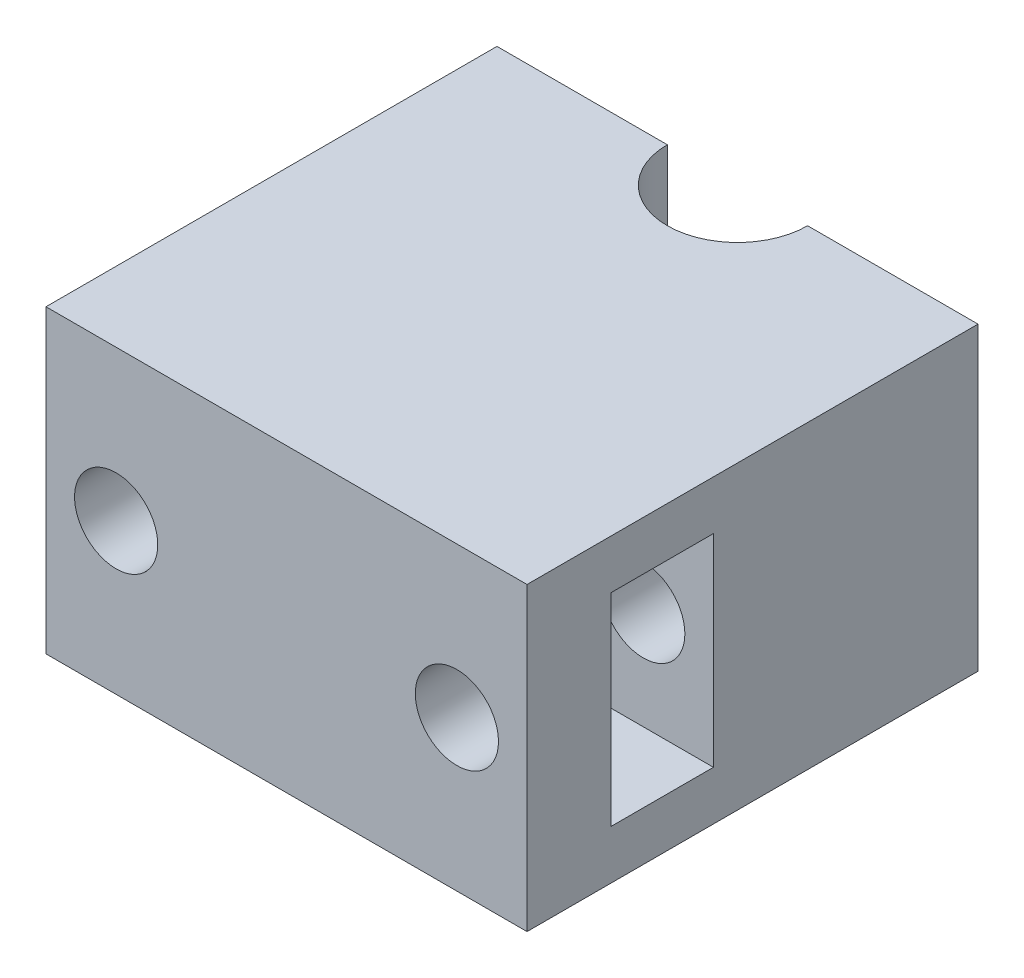
ISO-10303-21;
HEADER;
FILE_DESCRIPTION(('STEP AP214'),'2;1');
FILE_NAME('part.step','',(''),(''),'','','');
FILE_SCHEMA(('AUTOMOTIVE_DESIGN { 1 0 10303 214 1 1 1 1 }'));
ENDSEC;
DATA;
#1=APPLICATION_CONTEXT('core data for automotive mechanical design processes');
#2=APPLICATION_PROTOCOL_DEFINITION('international standard','automotive_design',2000,#1);
#3=PRODUCT_CONTEXT('',#1,'mechanical');
#4=PRODUCT('Part','Part','',(#3));
#5=PRODUCT_RELATED_PRODUCT_CATEGORY('part','',(#4));
#6=PRODUCT_DEFINITION_FORMATION('','',#4);
#7=PRODUCT_DEFINITION_CONTEXT('part definition',#1,'design');
#8=PRODUCT_DEFINITION('design','',#6,#7);
#9=PRODUCT_DEFINITION_SHAPE('','',#8);
#10=(LENGTH_UNIT() NAMED_UNIT(*) SI_UNIT(.MILLI.,.METRE.));
#11=(NAMED_UNIT(*) PLANE_ANGLE_UNIT() SI_UNIT($,.RADIAN.));
#12=(NAMED_UNIT(*) SI_UNIT($,.STERADIAN.) SOLID_ANGLE_UNIT());
#13=UNCERTAINTY_MEASURE_WITH_UNIT(LENGTH_MEASURE(1.E-05),#10,'distance_accuracy_value','');
#14=(GEOMETRIC_REPRESENTATION_CONTEXT(3) GLOBAL_UNCERTAINTY_ASSIGNED_CONTEXT((#13)) GLOBAL_UNIT_ASSIGNED_CONTEXT((#10,
#11,#12)) REPRESENTATION_CONTEXT('',''));
#15=CARTESIAN_POINT('',(0.,0.,0.));
#16=DIRECTION('',(0.,0.,1.));
#17=DIRECTION('',(1.,0.,0.));
#18=AXIS2_PLACEMENT_3D('',#15,#16,#17);
#19=CARTESIAN_POINT('',(24.,30.,-22.5));
#20=DIRECTION('',(0.,0.,1.));
#21=DIRECTION('',(1.,0.,0.));
#22=AXIS2_PLACEMENT_3D('',#19,#20,#21);
#23=PLANE('',#22);
#24=CARTESIAN_POINT('',(-17.,15.,-22.5));
#25=DIRECTION('',(0.,0.,1.));
#26=DIRECTION('',(1.,0.,0.));
#27=AXIS2_PLACEMENT_3D('',#24,#25,#26);
#28=CIRCLE('',#27,4.15);
#29=CARTESIAN_POINT('',(-12.85,15.,-22.5));
#30=VERTEX_POINT('',#29);
#31=EDGE_CURVE('E158',#30,#30,#28,.T.);
#32=ORIENTED_EDGE('',*,*,#31,.T.);
#33=EDGE_LOOP('',(#32));
#34=FACE_BOUND('',#33,.T.);
#35=DIRECTION('',(0.,-1.,0.));
#36=VECTOR('',#35,1.);
#37=CARTESIAN_POINT('',(-7.,137.757696924736,-22.5));
#38=LINE('',#37,#36);
#39=CARTESIAN_POINT('',(-7.,30.,-22.5));
#40=VERTEX_POINT('',#39);
#41=CARTESIAN_POINT('',(-7.,0.,-22.5));
#42=VERTEX_POINT('',#41);
#43=EDGE_CURVE('E139',#40,#42,#38,.T.);
#44=ORIENTED_EDGE('',*,*,#43,.T.);
#45=DIRECTION('',(-1.,0.,0.));
#46=VECTOR('',#45,1.);
#47=CARTESIAN_POINT('',(24.,0.,-22.5));
#48=LINE('',#47,#46);
#49=CARTESIAN_POINT('',(-24.,0.,-22.5));
#50=VERTEX_POINT('',#49);
#51=EDGE_CURVE('E126',#42,#50,#48,.T.);
#52=ORIENTED_EDGE('',*,*,#51,.T.);
#53=DIRECTION('',(0.,-1.,0.));
#54=VECTOR('',#53,1.);
#55=CARTESIAN_POINT('',(-24.,30.,-22.5));
#56=LINE('',#55,#54);
#57=CARTESIAN_POINT('',(-24.,30.,-22.5));
#58=VERTEX_POINT('',#57);
#59=EDGE_CURVE('E210',#58,#50,#56,.T.);
#60=ORIENTED_EDGE('',*,*,#59,.F.);
#61=DIRECTION('',(-1.,0.,0.));
#62=VECTOR('',#61,1.);
#63=CARTESIAN_POINT('',(24.,30.,-22.5));
#64=LINE('',#63,#62);
#65=EDGE_CURVE('E140',#40,#58,#64,.T.);
#66=ORIENTED_EDGE('',*,*,#65,.F.);
#67=EDGE_LOOP('',(#44,#52,#60,#66));
#68=FACE_BOUND('',#67,.T.);
#69=ADVANCED_FACE('F36',(#34,#68),#23,.F.);
#70=CARTESIAN_POINT('',(17.,15.,-22.5));
#71=DIRECTION('',(0.,0.,1.));
#72=DIRECTION('',(1.,0.,0.));
#73=AXIS2_PLACEMENT_3D('',#70,#71,#72);
#74=CIRCLE('',#73,4.15);
#75=CARTESIAN_POINT('',(21.15,15.,-22.5));
#76=VERTEX_POINT('',#75);
#77=EDGE_CURVE('E148',#76,#76,#74,.T.);
#78=ORIENTED_EDGE('',*,*,#77,.T.);
#79=EDGE_LOOP('',(#78));
#80=FACE_BOUND('',#79,.T.);
#81=DIRECTION('',(0.,-1.,0.));
#82=VECTOR('',#81,1.);
#83=CARTESIAN_POINT('',(7.,137.757696924736,-22.5));
#84=LINE('',#83,#82);
#85=CARTESIAN_POINT('',(7.,30.,-22.5));
#86=VERTEX_POINT('',#85);
#87=CARTESIAN_POINT('',(7.,0.,-22.5));
#88=VERTEX_POINT('',#87);
#89=EDGE_CURVE('E59',#86,#88,#84,.T.);
#90=ORIENTED_EDGE('',*,*,#89,.F.);
#91=CARTESIAN_POINT('',(24.,30.,-22.5));
#92=VERTEX_POINT('',#91);
#93=EDGE_CURVE('E208',#92,#86,#64,.T.);
#94=ORIENTED_EDGE('',*,*,#93,.F.);
#95=DIRECTION('',(0.,-1.,0.));
#96=VECTOR('',#95,1.);
#97=CARTESIAN_POINT('',(24.,30.,-22.5));
#98=LINE('',#97,#96);
#99=CARTESIAN_POINT('',(24.,0.,-22.5));
#100=VERTEX_POINT('',#99);
#101=EDGE_CURVE('E216',#92,#100,#98,.T.);
#102=ORIENTED_EDGE('',*,*,#101,.T.);
#103=EDGE_CURVE('E135',#100,#88,#48,.T.);
#104=ORIENTED_EDGE('',*,*,#103,.T.);
#105=EDGE_LOOP('',(#90,#94,#102,#104));
#106=FACE_BOUND('',#105,.T.);
#107=ADVANCED_FACE('F249',(#80,#106),#23,.F.);
#108=CARTESIAN_POINT('',(0.,30.,0.));
#109=DIRECTION('',(0.,1.,0.));
#110=DIRECTION('',(0.,0.,1.));
#111=AXIS2_PLACEMENT_3D('',#108,#109,#110);
#112=PLANE('',#111);
#113=ORIENTED_EDGE('',*,*,#93,.T.);
#114=CARTESIAN_POINT('',(0.,30.,-22.5));
#115=DIRECTION('',(0.,1.,0.));
#116=DIRECTION('',(0.,0.,1.));
#117=AXIS2_PLACEMENT_3D('',#114,#115,#116);
#118=CIRCLE('',#117,7.);
#119=EDGE_CURVE('E51',#86,#40,#118,.F.);
#120=ORIENTED_EDGE('',*,*,#119,.T.);
#121=ORIENTED_EDGE('',*,*,#65,.T.);
#122=DIRECTION('',(0.,0.,1.));
#123=VECTOR('',#122,1.);
#124=CARTESIAN_POINT('',(-24.,30.,22.5));
#125=LINE('',#124,#123);
#126=CARTESIAN_POINT('',(-24.,30.,22.5));
#127=VERTEX_POINT('',#126);
#128=EDGE_CURVE('E201',#58,#127,#125,.T.);
#129=ORIENTED_EDGE('',*,*,#128,.T.);
#130=DIRECTION('',(1.,0.,0.));
#131=VECTOR('',#130,1.);
#132=CARTESIAN_POINT('',(24.,30.,22.5));
#133=LINE('',#132,#131);
#134=CARTESIAN_POINT('',(24.,30.,22.5));
#135=VERTEX_POINT('',#134);
#136=EDGE_CURVE('E204',#127,#135,#133,.T.);
#137=ORIENTED_EDGE('',*,*,#136,.T.);
#138=DIRECTION('',(0.,0.,-1.));
#139=VECTOR('',#138,1.);
#140=CARTESIAN_POINT('',(24.,30.,22.5));
#141=LINE('',#140,#139);
#142=EDGE_CURVE('E206',#135,#92,#141,.T.);
#143=ORIENTED_EDGE('',*,*,#142,.T.);
#144=EDGE_LOOP('',(#113,#120,#121,#129,#137,#143));
#145=FACE_BOUND('',#144,.T.);
#146=ADVANCED_FACE('F255',(#145),#112,.T.);
#147=CARTESIAN_POINT('',(0.,0.,0.));
#148=DIRECTION('',(0.,1.,0.));
#149=DIRECTION('',(0.,0.,1.));
#150=AXIS2_PLACEMENT_3D('',#147,#148,#149);
#151=PLANE('',#150);
#152=CARTESIAN_POINT('',(0.,0.,-22.5));
#153=DIRECTION('',(0.,1.,0.));
#154=DIRECTION('',(0.,0.,1.));
#155=AXIS2_PLACEMENT_3D('',#152,#153,#154);
#156=CIRCLE('',#155,7.);
#157=EDGE_CURVE('E12',#88,#42,#156,.F.);
#158=ORIENTED_EDGE('',*,*,#157,.F.);
#159=ORIENTED_EDGE('',*,*,#103,.F.);
#160=DIRECTION('',(0.,0.,-1.));
#161=VECTOR('',#160,1.);
#162=CARTESIAN_POINT('',(24.,0.,22.5));
#163=LINE('',#162,#161);
#164=CARTESIAN_POINT('',(24.,0.,22.5));
#165=VERTEX_POINT('',#164);
#166=EDGE_CURVE('E136',#165,#100,#163,.T.);
#167=ORIENTED_EDGE('',*,*,#166,.F.);
#168=DIRECTION('',(1.,0.,0.));
#169=VECTOR('',#168,1.);
#170=CARTESIAN_POINT('',(24.,0.,22.5));
#171=LINE('',#170,#169);
#172=CARTESIAN_POINT('',(-24.,0.,22.5));
#173=VERTEX_POINT('',#172);
#174=EDGE_CURVE('E212',#173,#165,#171,.T.);
#175=ORIENTED_EDGE('',*,*,#174,.F.);
#176=DIRECTION('',(0.,0.,1.));
#177=VECTOR('',#176,1.);
#178=CARTESIAN_POINT('',(-24.,0.,22.5));
#179=LINE('',#178,#177);
#180=EDGE_CURVE('E131',#50,#173,#179,.T.);
#181=ORIENTED_EDGE('',*,*,#180,.F.);
#182=ORIENTED_EDGE('',*,*,#51,.F.);
#183=EDGE_LOOP('',(#158,#159,#167,#175,#181,#182));
#184=FACE_BOUND('',#183,.T.);
#185=ADVANCED_FACE('F128',(#184),#151,.F.);
#186=CARTESIAN_POINT('',(-21.,30.,22.5));
#187=DIRECTION('',(1.,0.,0.));
#188=DIRECTION('',(0.,0.,-1.));
#189=AXIS2_PLACEMENT_3D('',#186,#187,#188);
#190=PLANE('',#189);
#191=DIRECTION('',(0.,0.,1.));
#192=VECTOR('',#191,1.);
#193=CARTESIAN_POINT('',(-21.,16.1056672193749,-22.5));
#194=LINE('',#193,#192);
#195=CARTESIAN_POINT('',(-21.,16.1056672193749,3.90000000000001));
#196=VERTEX_POINT('',#195);
#197=CARTESIAN_POINT('',(-21.,16.1056672193749,14.1));
#198=VERTEX_POINT('',#197);
#199=EDGE_CURVE('E44',#196,#198,#194,.T.);
#200=ORIENTED_EDGE('',*,*,#199,.F.);
#201=DIRECTION('',(0.,-1.,0.));
#202=VECTOR('',#201,1.);
#203=CARTESIAN_POINT('',(-21.,4.9,3.90000000000001));
#204=LINE('',#203,#202);
#205=CARTESIAN_POINT('',(-21.,25.1,3.90000000000001));
#206=VERTEX_POINT('',#205);
#207=EDGE_CURVE('E177',#206,#196,#204,.T.);
#208=ORIENTED_EDGE('',*,*,#207,.F.);
#209=DIRECTION('',(0.,0.,-1.));
#210=VECTOR('',#209,1.);
#211=CARTESIAN_POINT('',(-21.,25.1,14.1));
#212=LINE('',#211,#210);
#213=CARTESIAN_POINT('',(-21.,25.1,14.1));
#214=VERTEX_POINT('',#213);
#215=EDGE_CURVE('E180',#214,#206,#212,.T.);
#216=ORIENTED_EDGE('',*,*,#215,.F.);
#217=DIRECTION('',(0.,1.,0.));
#218=VECTOR('',#217,1.);
#219=CARTESIAN_POINT('',(-21.,4.9,14.1));
#220=LINE('',#219,#218);
#221=EDGE_CURVE('E174',#198,#214,#220,.T.);
#222=ORIENTED_EDGE('',*,*,#221,.F.);
#223=EDGE_LOOP('',(#200,#208,#216,#222));
#224=FACE_BOUND('',#223,.T.);
#225=ADVANCED_FACE('F270',(#224),#190,.T.);
#226=CARTESIAN_POINT('',(-24.,30.,22.5));
#227=DIRECTION('',(1.,0.,0.));
#228=DIRECTION('',(0.,0.,-1.));
#229=AXIS2_PLACEMENT_3D('',#226,#227,#228);
#230=PLANE('',#229);
#231=ORIENTED_EDGE('',*,*,#180,.T.);
#232=DIRECTION('',(0.,-1.,0.));
#233=VECTOR('',#232,1.);
#234=CARTESIAN_POINT('',(-24.,30.,22.5));
#235=LINE('',#234,#233);
#236=EDGE_CURVE('E222',#127,#173,#235,.T.);
#237=ORIENTED_EDGE('',*,*,#236,.F.);
#238=ORIENTED_EDGE('',*,*,#128,.F.);
#239=ORIENTED_EDGE('',*,*,#59,.T.);
#240=EDGE_LOOP('',(#231,#237,#238,#239));
#241=FACE_BOUND('',#240,.T.);
#242=ADVANCED_FACE('F38',(#241),#230,.F.);
#243=CARTESIAN_POINT('',(24.,30.,22.5));
#244=DIRECTION('',(0.,0.,-1.));
#245=DIRECTION('',(-1.,0.,0.));
#246=AXIS2_PLACEMENT_3D('',#243,#244,#245);
#247=PLANE('',#246);
#248=CARTESIAN_POINT('',(17.,15.,22.5));
#249=DIRECTION('',(0.,0.,1.));
#250=DIRECTION('',(1.,0.,0.));
#251=AXIS2_PLACEMENT_3D('',#248,#249,#250);
#252=CIRCLE('',#251,4.15);
#253=CARTESIAN_POINT('',(21.15,15.,22.5));
#254=VERTEX_POINT('',#253);
#255=EDGE_CURVE('E145',#254,#254,#252,.T.);
#256=ORIENTED_EDGE('',*,*,#255,.F.);
#257=EDGE_LOOP('',(#256));
#258=FACE_BOUND('',#257,.T.);
#259=CARTESIAN_POINT('',(-17.,15.,22.5));
#260=DIRECTION('',(0.,0.,1.));
#261=DIRECTION('',(1.,0.,0.));
#262=AXIS2_PLACEMENT_3D('',#259,#260,#261);
#263=CIRCLE('',#262,4.15);
#264=CARTESIAN_POINT('',(-12.85,15.,22.5));
#265=VERTEX_POINT('',#264);
#266=EDGE_CURVE('E157',#265,#265,#263,.T.);
#267=ORIENTED_EDGE('',*,*,#266,.F.);
#268=EDGE_LOOP('',(#267));
#269=FACE_BOUND('',#268,.T.);
#270=ORIENTED_EDGE('',*,*,#174,.T.);
#271=DIRECTION('',(0.,-1.,0.));
#272=VECTOR('',#271,1.);
#273=CARTESIAN_POINT('',(24.,30.,22.5));
#274=LINE('',#273,#272);
#275=EDGE_CURVE('E219',#135,#165,#274,.T.);
#276=ORIENTED_EDGE('',*,*,#275,.F.);
#277=ORIENTED_EDGE('',*,*,#136,.F.);
#278=ORIENTED_EDGE('',*,*,#236,.T.);
#279=EDGE_LOOP('',(#270,#276,#277,#278));
#280=FACE_BOUND('',#279,.T.);
#281=ADVANCED_FACE('F263',(#258,#269,#280),#247,.F.);
#282=CARTESIAN_POINT('',(24.,30.,22.5));
#283=DIRECTION('',(-1.,0.,0.));
#284=DIRECTION('',(0.,0.,1.));
#285=AXIS2_PLACEMENT_3D('',#282,#283,#284);
#286=PLANE('',#285);
#287=DIRECTION('',(0.,0.,1.));
#288=VECTOR('',#287,1.);
#289=CARTESIAN_POINT('',(24.,25.1,14.1));
#290=LINE('',#289,#288);
#291=CARTESIAN_POINT('',(24.,25.1,3.90000000000001));
#292=VERTEX_POINT('',#291);
#293=CARTESIAN_POINT('',(24.,25.1,14.1));
#294=VERTEX_POINT('',#293);
#295=EDGE_CURVE('E182',#292,#294,#290,.T.);
#296=ORIENTED_EDGE('',*,*,#295,.F.);
#297=DIRECTION('',(0.,1.,0.));
#298=VECTOR('',#297,1.);
#299=CARTESIAN_POINT('',(24.,4.9,3.90000000000001));
#300=LINE('',#299,#298);
#301=CARTESIAN_POINT('',(24.,4.9,3.90000000000001));
#302=VERTEX_POINT('',#301);
#303=EDGE_CURVE('E169',#302,#292,#300,.T.);
#304=ORIENTED_EDGE('',*,*,#303,.F.);
#305=DIRECTION('',(0.,0.,-1.));
#306=VECTOR('',#305,1.);
#307=CARTESIAN_POINT('',(24.,4.9,14.1));
#308=LINE('',#307,#306);
#309=CARTESIAN_POINT('',(24.,4.9,14.1));
#310=VERTEX_POINT('',#309);
#311=EDGE_CURVE('E188',#310,#302,#308,.T.);
#312=ORIENTED_EDGE('',*,*,#311,.F.);
#313=DIRECTION('',(0.,-1.,0.));
#314=VECTOR('',#313,1.);
#315=CARTESIAN_POINT('',(24.,4.9,14.1));
#316=LINE('',#315,#314);
#317=EDGE_CURVE('E185',#294,#310,#316,.T.);
#318=ORIENTED_EDGE('',*,*,#317,.F.);
#319=EDGE_LOOP('',(#296,#304,#312,#318));
#320=FACE_BOUND('',#319,.T.);
#321=ORIENTED_EDGE('',*,*,#166,.T.);
#322=ORIENTED_EDGE('',*,*,#101,.F.);
#323=ORIENTED_EDGE('',*,*,#142,.F.);
#324=ORIENTED_EDGE('',*,*,#275,.T.);
#325=EDGE_LOOP('',(#321,#322,#323,#324));
#326=FACE_BOUND('',#325,.T.);
#327=ADVANCED_FACE('F260',(#320,#326),#286,.F.);
#328=CARTESIAN_POINT('',(-46.6291846958745,4.9,3.90000000000001));
#329=DIRECTION('',(0.,0.,-1.));
#330=DIRECTION('',(-1.,0.,0.));
#331=AXIS2_PLACEMENT_3D('',#328,#329,#330);
#332=PLANE('',#331);
#333=CARTESIAN_POINT('',(17.,15.,3.90000000000001));
#334=DIRECTION('',(0.,0.,-1.));
#335=DIRECTION('',(-1.,0.,0.));
#336=AXIS2_PLACEMENT_3D('',#333,#334,#335);
#337=CIRCLE('',#336,4.15);
#338=CARTESIAN_POINT('',(12.85,15.,3.90000000000001));
#339=VERTEX_POINT('',#338);
#340=EDGE_CURVE('E154',#339,#339,#337,.T.);
#341=ORIENTED_EDGE('',*,*,#340,.T.);
#342=EDGE_LOOP('',(#341));
#343=FACE_BOUND('',#342,.T.);
#344=ORIENTED_EDGE('',*,*,#207,.T.);
#345=CARTESIAN_POINT('',(-17.,15.,3.90000000000001));
#346=DIRECTION('',(0.,0.,-1.));
#347=DIRECTION('',(-1.,0.,0.));
#348=AXIS2_PLACEMENT_3D('',#345,#346,#347);
#349=CIRCLE('',#348,4.15);
#350=CARTESIAN_POINT('',(-21.,13.8943327806251,3.90000000000001));
#351=VERTEX_POINT('',#350);
#352=EDGE_CURVE('E166',#196,#351,#349,.T.);
#353=ORIENTED_EDGE('',*,*,#352,.T.);
#354=CARTESIAN_POINT('',(-21.,4.9,3.90000000000001));
#355=VERTEX_POINT('',#354);
#356=EDGE_CURVE('E176',#351,#355,#204,.T.);
#357=ORIENTED_EDGE('',*,*,#356,.T.);
#358=DIRECTION('',(1.,0.,0.));
#359=VECTOR('',#358,1.);
#360=CARTESIAN_POINT('',(-46.6291846958745,4.9,3.90000000000001));
#361=LINE('',#360,#359);
#362=EDGE_CURVE('E192',#355,#302,#361,.T.);
#363=ORIENTED_EDGE('',*,*,#362,.T.);
#364=ORIENTED_EDGE('',*,*,#303,.T.);
#365=DIRECTION('',(1.,0.,0.));
#366=VECTOR('',#365,1.);
#367=CARTESIAN_POINT('',(-46.6291846958745,25.1,3.90000000000001));
#368=LINE('',#367,#366);
#369=EDGE_CURVE('E191',#206,#292,#368,.T.);
#370=ORIENTED_EDGE('',*,*,#369,.F.);
#371=EDGE_LOOP('',(#344,#353,#357,#363,#364,#370));
#372=FACE_BOUND('',#371,.T.);
#373=ADVANCED_FACE('F262',(#343,#372),#332,.F.);
#374=CARTESIAN_POINT('',(-46.6291846958745,4.9,14.1));
#375=DIRECTION('',(0.,-1.,0.));
#376=DIRECTION('',(0.,0.,-1.));
#377=AXIS2_PLACEMENT_3D('',#374,#375,#376);
#378=PLANE('',#377);
#379=DIRECTION('',(0.,0.,1.));
#380=VECTOR('',#379,1.);
#381=CARTESIAN_POINT('',(-21.,4.9,14.1));
#382=LINE('',#381,#380);
#383=CARTESIAN_POINT('',(-21.,4.9,14.1));
#384=VERTEX_POINT('',#383);
#385=EDGE_CURVE('E173',#355,#384,#382,.T.);
#386=ORIENTED_EDGE('',*,*,#385,.T.);
#387=DIRECTION('',(1.,0.,0.));
#388=VECTOR('',#387,1.);
#389=CARTESIAN_POINT('',(-46.6291846958745,4.9,14.1));
#390=LINE('',#389,#388);
#391=EDGE_CURVE('E194',#384,#310,#390,.T.);
#392=ORIENTED_EDGE('',*,*,#391,.T.);
#393=ORIENTED_EDGE('',*,*,#311,.T.);
#394=ORIENTED_EDGE('',*,*,#362,.F.);
#395=EDGE_LOOP('',(#386,#392,#393,#394));
#396=FACE_BOUND('',#395,.T.);
#397=ADVANCED_FACE('F290',(#396),#378,.F.);
#398=CARTESIAN_POINT('',(-46.6291846958745,4.9,14.1));
#399=DIRECTION('',(0.,0.,1.));
#400=DIRECTION('',(1.,0.,0.));
#401=AXIS2_PLACEMENT_3D('',#398,#399,#400);
#402=PLANE('',#401);
#403=CARTESIAN_POINT('',(17.,15.,14.1));
#404=DIRECTION('',(0.,0.,1.));
#405=DIRECTION('',(1.,0.,0.));
#406=AXIS2_PLACEMENT_3D('',#403,#404,#405);
#407=CIRCLE('',#406,4.15);
#408=CARTESIAN_POINT('',(21.15,15.,14.1));
#409=VERTEX_POINT('',#408);
#410=EDGE_CURVE('E151',#409,#409,#407,.T.);
#411=ORIENTED_EDGE('',*,*,#410,.T.);
#412=EDGE_LOOP('',(#411));
#413=FACE_BOUND('',#412,.T.);
#414=CARTESIAN_POINT('',(-21.,13.8943327806251,14.1));
#415=VERTEX_POINT('',#414);
#416=EDGE_CURVE('E170',#384,#415,#220,.T.);
#417=ORIENTED_EDGE('',*,*,#416,.T.);
#418=CARTESIAN_POINT('',(-17.,15.,14.1));
#419=DIRECTION('',(0.,0.,1.));
#420=DIRECTION('',(1.,0.,0.));
#421=AXIS2_PLACEMENT_3D('',#418,#419,#420);
#422=CIRCLE('',#421,4.15);
#423=EDGE_CURVE('E161',#415,#198,#422,.T.);
#424=ORIENTED_EDGE('',*,*,#423,.T.);
#425=ORIENTED_EDGE('',*,*,#221,.T.);
#426=DIRECTION('',(1.,0.,0.));
#427=VECTOR('',#426,1.);
#428=CARTESIAN_POINT('',(-46.6291846958745,25.1,14.1));
#429=LINE('',#428,#427);
#430=EDGE_CURVE('E196',#214,#294,#429,.T.);
#431=ORIENTED_EDGE('',*,*,#430,.T.);
#432=ORIENTED_EDGE('',*,*,#317,.T.);
#433=ORIENTED_EDGE('',*,*,#391,.F.);
#434=EDGE_LOOP('',(#417,#424,#425,#431,#432,#433));
#435=FACE_BOUND('',#434,.T.);
#436=ADVANCED_FACE('F230',(#413,#435),#402,.F.);
#437=CARTESIAN_POINT('',(-46.6291846958745,25.1,14.1));
#438=DIRECTION('',(0.,1.,0.));
#439=DIRECTION('',(0.,0.,1.));
#440=AXIS2_PLACEMENT_3D('',#437,#438,#439);
#441=PLANE('',#440);
#442=ORIENTED_EDGE('',*,*,#215,.T.);
#443=ORIENTED_EDGE('',*,*,#369,.T.);
#444=ORIENTED_EDGE('',*,*,#295,.T.);
#445=ORIENTED_EDGE('',*,*,#430,.F.);
#446=EDGE_LOOP('',(#442,#443,#444,#445));
#447=FACE_BOUND('',#446,.T.);
#448=ADVANCED_FACE('F292',(#447),#441,.F.);
#449=DIRECTION('',(0.,0.,1.));
#450=VECTOR('',#449,1.);
#451=CARTESIAN_POINT('',(-21.,13.8943327806251,-22.5));
#452=LINE('',#451,#450);
#453=EDGE_CURVE('E225',#415,#351,#452,.F.);
#454=ORIENTED_EDGE('',*,*,#453,.F.);
#455=ORIENTED_EDGE('',*,*,#416,.F.);
#456=ORIENTED_EDGE('',*,*,#385,.F.);
#457=ORIENTED_EDGE('',*,*,#356,.F.);
#458=EDGE_LOOP('',(#454,#455,#456,#457));
#459=FACE_BOUND('',#458,.T.);
#460=ADVANCED_FACE('F244',(#459),#190,.T.);
#461=CARTESIAN_POINT('',(-17.,15.,-22.5));
#462=DIRECTION('',(0.,0.,1.));
#463=DIRECTION('',(1.,0.,0.));
#464=AXIS2_PLACEMENT_3D('',#461,#462,#463);
#465=CYLINDRICAL_SURFACE('',#464,4.15);
#466=ORIENTED_EDGE('',*,*,#199,.T.);
#467=ORIENTED_EDGE('',*,*,#423,.F.);
#468=ORIENTED_EDGE('',*,*,#453,.T.);
#469=ORIENTED_EDGE('',*,*,#352,.F.);
#470=EDGE_LOOP('',(#466,#467,#468,#469));
#471=FACE_BOUND('',#470,.T.);
#472=ORIENTED_EDGE('',*,*,#31,.F.);
#473=EDGE_LOOP('',(#472));
#474=FACE_BOUND('',#473,.T.);
#475=ORIENTED_EDGE('',*,*,#266,.T.);
#476=EDGE_LOOP('',(#475));
#477=FACE_BOUND('',#476,.T.);
#478=ADVANCED_FACE('F236',(#471,#474,#477),#465,.F.);
#479=CARTESIAN_POINT('',(17.,15.,-22.5));
#480=DIRECTION('',(0.,0.,1.));
#481=DIRECTION('',(1.,0.,0.));
#482=AXIS2_PLACEMENT_3D('',#479,#480,#481);
#483=CYLINDRICAL_SURFACE('',#482,4.15);
#484=ORIENTED_EDGE('',*,*,#255,.T.);
#485=EDGE_LOOP('',(#484));
#486=FACE_BOUND('',#485,.T.);
#487=ORIENTED_EDGE('',*,*,#410,.F.);
#488=EDGE_LOOP('',(#487));
#489=FACE_BOUND('',#488,.T.);
#490=ADVANCED_FACE('F233',(#486,#489),#483,.F.);
#491=ORIENTED_EDGE('',*,*,#77,.F.);
#492=EDGE_LOOP('',(#491));
#493=FACE_BOUND('',#492,.T.);
#494=ORIENTED_EDGE('',*,*,#340,.F.);
#495=EDGE_LOOP('',(#494));
#496=FACE_BOUND('',#495,.T.);
#497=ADVANCED_FACE('F235',(#493,#496),#483,.F.);
#498=CARTESIAN_POINT('',(0.,137.757696924736,-22.5));
#499=DIRECTION('',(0.,-1.,0.));
#500=DIRECTION('',(0.,0.,-1.));
#501=AXIS2_PLACEMENT_3D('',#498,#499,#500);
#502=CYLINDRICAL_SURFACE('',#501,7.);
#503=ORIENTED_EDGE('',*,*,#119,.F.);
#504=ORIENTED_EDGE('',*,*,#89,.T.);
#505=ORIENTED_EDGE('',*,*,#157,.T.);
#506=ORIENTED_EDGE('',*,*,#43,.F.);
#507=EDGE_LOOP('',(#503,#504,#505,#506));
#508=FACE_BOUND('',#507,.T.);
#509=ADVANCED_FACE('F143',(#508),#502,.F.);
#510=CLOSED_SHELL('',(#69,#107,#146,#185,#225,#242,#281,#327,#373,#397,#436,#448,#460,#478,#490,
#497,#509));
#511=MANIFOLD_SOLID_BREP('B2',#510);
#512=ADVANCED_BREP_SHAPE_REPRESENTATION('',(#18,#511),#14);
#513=SHAPE_DEFINITION_REPRESENTATION(#9,#512);
ENDSEC;
END-ISO-10303-21;
